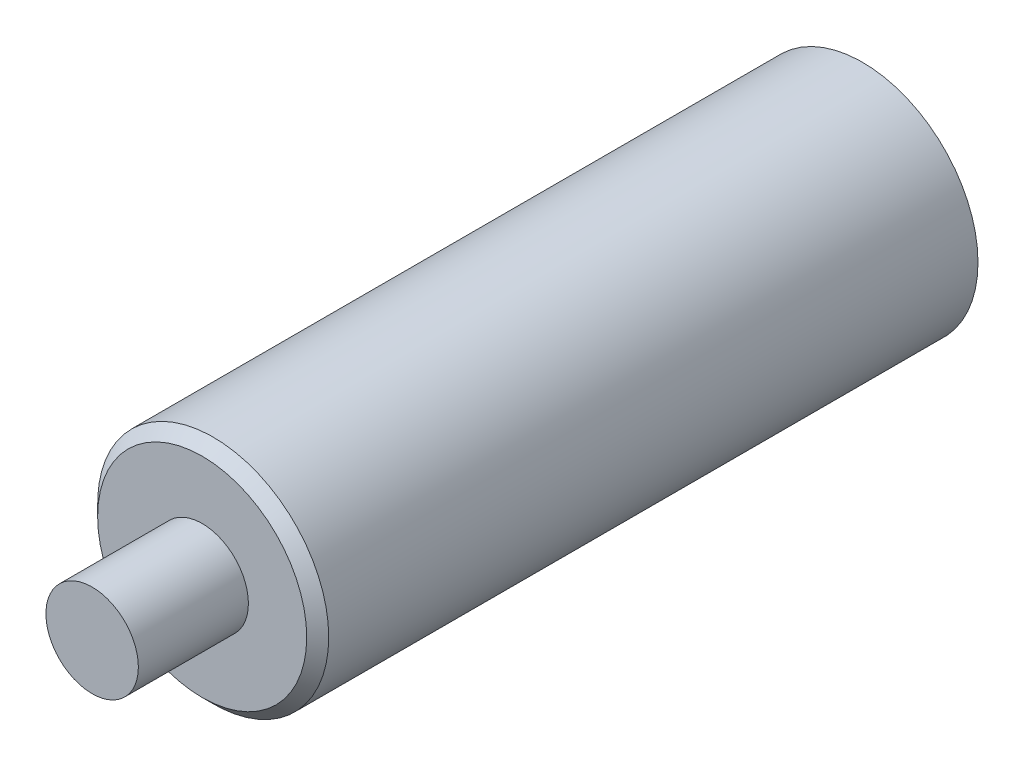
ISO-10303-21;
HEADER;
FILE_DESCRIPTION(('STEP AP214'),'2;1');
FILE_NAME('part.step','',(''),(''),'','','');
FILE_SCHEMA(('AUTOMOTIVE_DESIGN { 1 0 10303 214 1 1 1 1 }'));
ENDSEC;
DATA;
#1=APPLICATION_CONTEXT('core data for automotive mechanical design processes');
#2=APPLICATION_PROTOCOL_DEFINITION('international standard','automotive_design',2000,#1);
#3=PRODUCT_CONTEXT('',#1,'mechanical');
#4=PRODUCT('Part','Part','',(#3));
#5=PRODUCT_RELATED_PRODUCT_CATEGORY('part','',(#4));
#6=PRODUCT_DEFINITION_FORMATION('','',#4);
#7=PRODUCT_DEFINITION_CONTEXT('part definition',#1,'design');
#8=PRODUCT_DEFINITION('design','',#6,#7);
#9=PRODUCT_DEFINITION_SHAPE('','',#8);
#10=(LENGTH_UNIT() NAMED_UNIT(*) SI_UNIT(.MILLI.,.METRE.));
#11=(NAMED_UNIT(*) PLANE_ANGLE_UNIT() SI_UNIT($,.RADIAN.));
#12=(NAMED_UNIT(*) SI_UNIT($,.STERADIAN.) SOLID_ANGLE_UNIT());
#13=UNCERTAINTY_MEASURE_WITH_UNIT(LENGTH_MEASURE(1.E-05),#10,'distance_accuracy_value','');
#14=(GEOMETRIC_REPRESENTATION_CONTEXT(3) GLOBAL_UNCERTAINTY_ASSIGNED_CONTEXT((#13)) GLOBAL_UNIT_ASSIGNED_CONTEXT((#10,
#11,#12)) REPRESENTATION_CONTEXT('',''));
#15=CARTESIAN_POINT('',(0.,0.,0.));
#16=DIRECTION('',(0.,0.,1.));
#17=DIRECTION('',(1.,0.,0.));
#18=AXIS2_PLACEMENT_3D('',#15,#16,#17);
#19=CARTESIAN_POINT('',(0.,0.,30.));
#20=DIRECTION('',(0.,0.,-1.));
#21=DIRECTION('',(-1.,0.,0.));
#22=AXIS2_PLACEMENT_3D('',#19,#20,#21);
#23=CYLINDRICAL_SURFACE('',#22,5.25);
#24=CARTESIAN_POINT('',(0.,0.,29.5));
#25=DIRECTION('',(0.,0.,1.));
#26=DIRECTION('',(1.,0.,0.));
#27=AXIS2_PLACEMENT_3D('',#24,#25,#26);
#28=CIRCLE('',#27,5.25);
#29=CARTESIAN_POINT('',(5.25,0.,29.5));
#30=VERTEX_POINT('',#29);
#31=EDGE_CURVE('E10',#30,#30,#28,.F.);
#32=ORIENTED_EDGE('',*,*,#31,.T.);
#33=EDGE_LOOP('',(#32));
#34=FACE_BOUND('',#33,.T.);
#35=CARTESIAN_POINT('',(0.,0.,0.));
#36=DIRECTION('',(0.,0.,1.));
#37=DIRECTION('',(1.,0.,0.));
#38=AXIS2_PLACEMENT_3D('',#35,#36,#37);
#39=CIRCLE('',#38,5.25);
#40=CARTESIAN_POINT('',(5.25,0.,0.));
#41=VERTEX_POINT('',#40);
#42=EDGE_CURVE('E42',#41,#41,#39,.T.);
#43=ORIENTED_EDGE('',*,*,#42,.T.);
#44=EDGE_LOOP('',(#43));
#45=FACE_BOUND('',#44,.T.);
#46=ADVANCED_FACE('F30',(#34,#45),#23,.T.);
#47=CARTESIAN_POINT('',(0.,0.,30.));
#48=DIRECTION('',(0.,0.,1.));
#49=DIRECTION('',(1.,0.,0.));
#50=AXIS2_PLACEMENT_3D('',#47,#48,#49);
#51=PLANE('',#50);
#52=CARTESIAN_POINT('',(0.,0.,30.));
#53=DIRECTION('',(0.,0.,1.));
#54=DIRECTION('',(1.,0.,0.));
#55=AXIS2_PLACEMENT_3D('',#52,#53,#54);
#56=CIRCLE('',#55,2.1);
#57=CARTESIAN_POINT('',(2.1,0.,30.));
#58=VERTEX_POINT('',#57);
#59=EDGE_CURVE('E51',#58,#58,#56,.T.);
#60=ORIENTED_EDGE('',*,*,#59,.F.);
#61=EDGE_LOOP('',(#60));
#62=FACE_BOUND('',#61,.T.);
#63=CARTESIAN_POINT('',(0.,0.,30.));
#64=DIRECTION('',(0.,0.,1.));
#65=DIRECTION('',(1.,0.,0.));
#66=AXIS2_PLACEMENT_3D('',#63,#64,#65);
#67=CIRCLE('',#66,4.75);
#68=CARTESIAN_POINT('',(4.75,0.,30.));
#69=VERTEX_POINT('',#68);
#70=EDGE_CURVE('E38',#69,#69,#67,.T.);
#71=ORIENTED_EDGE('',*,*,#70,.T.);
#72=EDGE_LOOP('',(#71));
#73=FACE_BOUND('',#72,.T.);
#74=ADVANCED_FACE('F66',(#62,#73),#51,.T.);
#75=CARTESIAN_POINT('',(0.,0.,0.));
#76=DIRECTION('',(0.,0.,1.));
#77=DIRECTION('',(1.,0.,0.));
#78=AXIS2_PLACEMENT_3D('',#75,#76,#77);
#79=PLANE('',#78);
#80=CARTESIAN_POINT('',(0.,0.,0.));
#81=DIRECTION('',(0.,0.,1.));
#82=DIRECTION('',(1.,0.,0.));
#83=AXIS2_PLACEMENT_3D('',#80,#81,#82);
#84=CIRCLE('',#83,1.75);
#85=CARTESIAN_POINT('',(1.75,0.,0.));
#86=VERTEX_POINT('',#85);
#87=EDGE_CURVE('E34',#86,#86,#84,.F.);
#88=ORIENTED_EDGE('',*,*,#87,.F.);
#89=EDGE_LOOP('',(#88));
#90=FACE_BOUND('',#89,.T.);
#91=ORIENTED_EDGE('',*,*,#42,.F.);
#92=EDGE_LOOP('',(#91));
#93=FACE_BOUND('',#92,.T.);
#94=ADVANCED_FACE('F69',(#90,#93),#79,.F.);
#95=CARTESIAN_POINT('',(0.,0.,30.));
#96=DIRECTION('',(0.,0.,-1.));
#97=DIRECTION('',(-1.,0.,0.));
#98=AXIS2_PLACEMENT_3D('',#95,#96,#97);
#99=CONICAL_SURFACE('',#98,4.75,0.785398163397444);
#100=ORIENTED_EDGE('',*,*,#31,.F.);
#101=EDGE_LOOP('',(#100));
#102=FACE_BOUND('',#101,.T.);
#103=ORIENTED_EDGE('',*,*,#70,.F.);
#104=EDGE_LOOP('',(#103));
#105=FACE_BOUND('',#104,.T.);
#106=ADVANCED_FACE('F32',(#102,#105),#99,.T.);
#107=CARTESIAN_POINT('',(0.,0.,-1.2E-05));
#108=DIRECTION('',(0.,0.,1.));
#109=DIRECTION('',(1.,0.,0.));
#110=AXIS2_PLACEMENT_3D('',#107,#108,#109);
#111=CYLINDRICAL_SURFACE('',#110,1.75);
#112=CARTESIAN_POINT('',(0.,0.,15.));
#113=DIRECTION('',(0.,0.,-1.));
#114=DIRECTION('',(-1.,0.,0.));
#115=AXIS2_PLACEMENT_3D('',#112,#113,#114);
#116=CIRCLE('',#115,1.75);
#117=CARTESIAN_POINT('',(-1.75,0.,15.));
#118=VERTEX_POINT('',#117);
#119=EDGE_CURVE('E47',#118,#118,#116,.T.);
#120=ORIENTED_EDGE('',*,*,#119,.F.);
#121=EDGE_LOOP('',(#120));
#122=FACE_BOUND('',#121,.T.);
#123=ORIENTED_EDGE('',*,*,#87,.T.);
#124=EDGE_LOOP('',(#123));
#125=FACE_BOUND('',#124,.T.);
#126=ADVANCED_FACE('F74',(#122,#125),#111,.F.);
#127=CARTESIAN_POINT('',(0.,0.,15.));
#128=DIRECTION('',(0.,0.,-1.));
#129=DIRECTION('',(-1.,0.,0.));
#130=AXIS2_PLACEMENT_3D('',#127,#128,#129);
#131=PLANE('',#130);
#132=ORIENTED_EDGE('',*,*,#119,.T.);
#133=EDGE_LOOP('',(#132));
#134=FACE_BOUND('',#133,.T.);
#135=ADVANCED_FACE('F62',(#134),#131,.T.);
#136=CARTESIAN_POINT('',(0.,0.,35.));
#137=DIRECTION('',(0.,0.,-1.));
#138=DIRECTION('',(-1.,0.,0.));
#139=AXIS2_PLACEMENT_3D('',#136,#137,#138);
#140=CYLINDRICAL_SURFACE('',#139,2.1);
#141=CARTESIAN_POINT('',(0.,0.,35.));
#142=DIRECTION('',(0.,0.,1.));
#143=DIRECTION('',(1.,0.,0.));
#144=AXIS2_PLACEMENT_3D('',#141,#142,#143);
#145=CIRCLE('',#144,2.1);
#146=CARTESIAN_POINT('',(2.1,0.,35.));
#147=VERTEX_POINT('',#146);
#148=EDGE_CURVE('E50',#147,#147,#145,.T.);
#149=ORIENTED_EDGE('',*,*,#148,.F.);
#150=EDGE_LOOP('',(#149));
#151=FACE_BOUND('',#150,.T.);
#152=ORIENTED_EDGE('',*,*,#59,.T.);
#153=EDGE_LOOP('',(#152));
#154=FACE_BOUND('',#153,.T.);
#155=ADVANCED_FACE('F59',(#151,#154),#140,.T.);
#156=CARTESIAN_POINT('',(0.,0.,35.));
#157=DIRECTION('',(0.,0.,1.));
#158=DIRECTION('',(1.,0.,0.));
#159=AXIS2_PLACEMENT_3D('',#156,#157,#158);
#160=PLANE('',#159);
#161=ORIENTED_EDGE('',*,*,#148,.T.);
#162=EDGE_LOOP('',(#161));
#163=FACE_BOUND('',#162,.T.);
#164=ADVANCED_FACE('F57',(#163),#160,.T.);
#165=CLOSED_SHELL('',(#46,#74,#94,#106,#126,#135,#155,#164));
#166=MANIFOLD_SOLID_BREP('B2',#165);
#167=ADVANCED_BREP_SHAPE_REPRESENTATION('',(#18,#166),#14);
#168=SHAPE_DEFINITION_REPRESENTATION(#9,#167);
ENDSEC;
END-ISO-10303-21;
